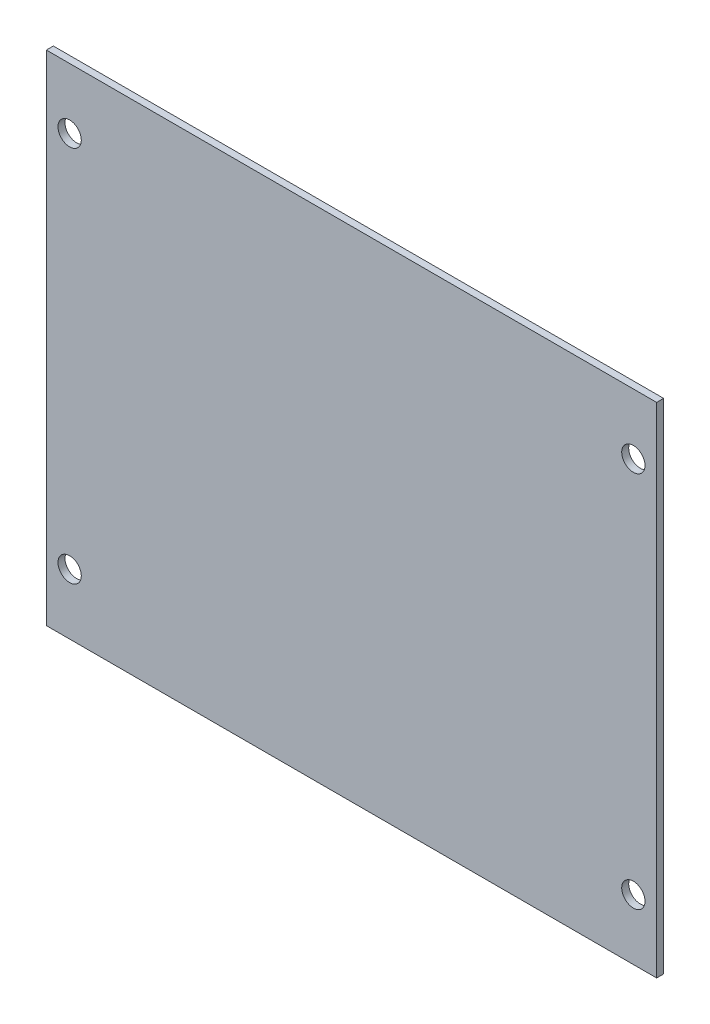
ISO-10303-21;
HEADER;
FILE_DESCRIPTION(('STEP AP214'),'2;1');
FILE_NAME('part.step','',(''),(''),'','','');
FILE_SCHEMA(('AUTOMOTIVE_DESIGN { 1 0 10303 214 1 1 1 1 }'));
ENDSEC;
DATA;
#1=APPLICATION_CONTEXT('core data for automotive mechanical design processes');
#2=APPLICATION_PROTOCOL_DEFINITION('international standard','automotive_design',2000,#1);
#3=PRODUCT_CONTEXT('',#1,'mechanical');
#4=PRODUCT('Part','Part','',(#3));
#5=PRODUCT_RELATED_PRODUCT_CATEGORY('part','',(#4));
#6=PRODUCT_DEFINITION_FORMATION('','',#4);
#7=PRODUCT_DEFINITION_CONTEXT('part definition',#1,'design');
#8=PRODUCT_DEFINITION('design','',#6,#7);
#9=PRODUCT_DEFINITION_SHAPE('','',#8);
#10=(LENGTH_UNIT() NAMED_UNIT(*) SI_UNIT(.MILLI.,.METRE.));
#11=(NAMED_UNIT(*) PLANE_ANGLE_UNIT() SI_UNIT($,.RADIAN.));
#12=(NAMED_UNIT(*) SI_UNIT($,.STERADIAN.) SOLID_ANGLE_UNIT());
#13=UNCERTAINTY_MEASURE_WITH_UNIT(LENGTH_MEASURE(1.E-05),#10,'distance_accuracy_value','');
#14=(GEOMETRIC_REPRESENTATION_CONTEXT(3) GLOBAL_UNCERTAINTY_ASSIGNED_CONTEXT((#13)) GLOBAL_UNIT_ASSIGNED_CONTEXT((#10,
#11,#12)) REPRESENTATION_CONTEXT('',''));
#15=CARTESIAN_POINT('',(0.,0.,0.));
#16=DIRECTION('',(0.,0.,1.));
#17=DIRECTION('',(1.,0.,0.));
#18=AXIS2_PLACEMENT_3D('',#15,#16,#17);
#19=CARTESIAN_POINT('',(-55.0355249406901,36.5593129963155,1.5));
#20=DIRECTION('',(1.,0.,0.));
#21=DIRECTION('',(0.,1.,0.));
#22=AXIS2_PLACEMENT_3D('',#19,#20,#21);
#23=PLANE('',#22);
#24=DIRECTION('',(0.,-1.,0.));
#25=VECTOR('',#24,1.);
#26=CARTESIAN_POINT('',(-55.0355249406901,36.5593129963155,0.));
#27=LINE('',#26,#25);
#28=CARTESIAN_POINT('',(-55.0355249406901,36.5593129963155,0.));
#29=VERTEX_POINT('',#28);
#30=CARTESIAN_POINT('',(-55.03552494069,-70.4406870036845,0.));
#31=VERTEX_POINT('',#30);
#32=EDGE_CURVE('E98',#29,#31,#27,.T.);
#33=ORIENTED_EDGE('',*,*,#32,.T.);
#34=DIRECTION('',(0.,0.,-1.));
#35=VECTOR('',#34,1.);
#36=CARTESIAN_POINT('',(-55.03552494069,-70.4406870036845,1.5));
#37=LINE('',#36,#35);
#38=CARTESIAN_POINT('',(-55.03552494069,-70.4406870036845,1.5));
#39=VERTEX_POINT('',#38);
#40=EDGE_CURVE('E11',#39,#31,#37,.T.);
#41=ORIENTED_EDGE('',*,*,#40,.F.);
#42=DIRECTION('',(0.,-1.,0.));
#43=VECTOR('',#42,1.);
#44=CARTESIAN_POINT('',(-55.0355249406901,36.5593129963155,1.5));
#45=LINE('',#44,#43);
#46=CARTESIAN_POINT('',(-55.0355249406901,36.5593129963155,1.5));
#47=VERTEX_POINT('',#46);
#48=EDGE_CURVE('E86',#47,#39,#45,.T.);
#49=ORIENTED_EDGE('',*,*,#48,.F.);
#50=DIRECTION('',(0.,0.,-1.));
#51=VECTOR('',#50,1.);
#52=CARTESIAN_POINT('',(-55.0355249406901,36.5593129963155,1.5));
#53=LINE('',#52,#51);
#54=EDGE_CURVE('E94',#47,#29,#53,.T.);
#55=ORIENTED_EDGE('',*,*,#54,.T.);
#56=EDGE_LOOP('',(#33,#41,#49,#55));
#57=FACE_BOUND('',#56,.T.);
#58=ADVANCED_FACE('F35',(#57),#23,.F.);
#59=CARTESIAN_POINT('',(-55.03552494069,-70.4406870036845,1.5));
#60=DIRECTION('',(0.,1.,0.));
#61=DIRECTION('',(0.,0.,1.));
#62=AXIS2_PLACEMENT_3D('',#59,#60,#61);
#63=PLANE('',#62);
#64=DIRECTION('',(1.,0.,0.));
#65=VECTOR('',#64,1.);
#66=CARTESIAN_POINT('',(-55.03552494069,-70.4406870036845,0.));
#67=LINE('',#66,#65);
#68=CARTESIAN_POINT('',(75.96447505931,-70.4406870036845,0.));
#69=VERTEX_POINT('',#68);
#70=EDGE_CURVE('E90',#31,#69,#67,.T.);
#71=ORIENTED_EDGE('',*,*,#70,.T.);
#72=DIRECTION('',(0.,0.,-1.));
#73=VECTOR('',#72,1.);
#74=CARTESIAN_POINT('',(75.96447505931,-70.4406870036845,1.5));
#75=LINE('',#74,#73);
#76=CARTESIAN_POINT('',(75.96447505931,-70.4406870036845,1.5));
#77=VERTEX_POINT('',#76);
#78=EDGE_CURVE('E43',#77,#69,#75,.T.);
#79=ORIENTED_EDGE('',*,*,#78,.F.);
#80=DIRECTION('',(1.,0.,0.));
#81=VECTOR('',#80,1.);
#82=CARTESIAN_POINT('',(-55.03552494069,-70.4406870036845,1.5));
#83=LINE('',#82,#81);
#84=EDGE_CURVE('E81',#39,#77,#83,.T.);
#85=ORIENTED_EDGE('',*,*,#84,.F.);
#86=ORIENTED_EDGE('',*,*,#40,.T.);
#87=EDGE_LOOP('',(#71,#79,#85,#86));
#88=FACE_BOUND('',#87,.T.);
#89=ADVANCED_FACE('F89',(#88),#63,.F.);
#90=CARTESIAN_POINT('',(75.9644750593099,36.5593129963155,1.5));
#91=DIRECTION('',(-1.,0.,0.));
#92=DIRECTION('',(0.,-1.,0.));
#93=AXIS2_PLACEMENT_3D('',#90,#91,#92);
#94=PLANE('',#93);
#95=DIRECTION('',(0.,1.,0.));
#96=VECTOR('',#95,1.);
#97=CARTESIAN_POINT('',(75.9644750593099,36.5593129963155,0.));
#98=LINE('',#97,#96);
#99=CARTESIAN_POINT('',(75.9644750593099,36.5593129963155,0.));
#100=VERTEX_POINT('',#99);
#101=EDGE_CURVE('E68',#69,#100,#98,.T.);
#102=ORIENTED_EDGE('',*,*,#101,.T.);
#103=DIRECTION('',(0.,0.,-1.));
#104=VECTOR('',#103,1.);
#105=CARTESIAN_POINT('',(75.9644750593099,36.5593129963155,1.5));
#106=LINE('',#105,#104);
#107=CARTESIAN_POINT('',(75.9644750593099,36.5593129963155,1.5));
#108=VERTEX_POINT('',#107);
#109=EDGE_CURVE('E91',#108,#100,#106,.T.);
#110=ORIENTED_EDGE('',*,*,#109,.F.);
#111=DIRECTION('',(0.,1.,0.));
#112=VECTOR('',#111,1.);
#113=CARTESIAN_POINT('',(75.9644750593099,36.5593129963155,1.5));
#114=LINE('',#113,#112);
#115=EDGE_CURVE('E84',#77,#108,#114,.T.);
#116=ORIENTED_EDGE('',*,*,#115,.F.);
#117=ORIENTED_EDGE('',*,*,#78,.T.);
#118=EDGE_LOOP('',(#102,#110,#116,#117));
#119=FACE_BOUND('',#118,.T.);
#120=ADVANCED_FACE('F92',(#119),#94,.F.);
#121=CARTESIAN_POINT('',(-55.0355249406901,36.5593129963155,1.5));
#122=DIRECTION('',(0.,-1.,0.));
#123=DIRECTION('',(0.,0.,-1.));
#124=AXIS2_PLACEMENT_3D('',#121,#122,#123);
#125=PLANE('',#124);
#126=DIRECTION('',(-1.,0.,0.));
#127=VECTOR('',#126,1.);
#128=CARTESIAN_POINT('',(-55.0355249406901,36.5593129963155,0.));
#129=LINE('',#128,#127);
#130=EDGE_CURVE('E74',#100,#29,#129,.T.);
#131=ORIENTED_EDGE('',*,*,#130,.T.);
#132=ORIENTED_EDGE('',*,*,#54,.F.);
#133=DIRECTION('',(-1.,0.,0.));
#134=VECTOR('',#133,1.);
#135=CARTESIAN_POINT('',(-55.0355249406901,36.5593129963155,1.5));
#136=LINE('',#135,#134);
#137=EDGE_CURVE('E51',#108,#47,#136,.T.);
#138=ORIENTED_EDGE('',*,*,#137,.F.);
#139=ORIENTED_EDGE('',*,*,#109,.T.);
#140=EDGE_LOOP('',(#131,#132,#138,#139));
#141=FACE_BOUND('',#140,.T.);
#142=ADVANCED_FACE('F106',(#141),#125,.F.);
#143=CARTESIAN_POINT('',(0.,0.,1.5));
#144=DIRECTION('',(0.,0.,1.));
#145=DIRECTION('',(1.,0.,0.));
#146=AXIS2_PLACEMENT_3D('',#143,#144,#145);
#147=PLANE('',#146);
#148=CARTESIAN_POINT('',(-50.0355249406901,-57.4406870036845,1.5));
#149=DIRECTION('',(0.,0.,1.));
#150=DIRECTION('',(1.,0.,0.));
#151=AXIS2_PLACEMENT_3D('',#148,#149,#150);
#152=CIRCLE('',#151,2.5);
#153=CARTESIAN_POINT('',(-47.5355249406901,-57.4406870036845,1.5));
#154=VERTEX_POINT('',#153);
#155=EDGE_CURVE('E132',#154,#154,#152,.T.);
#156=ORIENTED_EDGE('',*,*,#155,.F.);
#157=EDGE_LOOP('',(#156));
#158=FACE_BOUND('',#157,.T.);
#159=CARTESIAN_POINT('',(70.96447505931,-57.4406870036845,1.5));
#160=DIRECTION('',(0.,0.,1.));
#161=DIRECTION('',(1.,0.,0.));
#162=AXIS2_PLACEMENT_3D('',#159,#160,#161);
#163=CIRCLE('',#162,2.5);
#164=CARTESIAN_POINT('',(73.46447505931,-57.4406870036845,1.5));
#165=VERTEX_POINT('',#164);
#166=EDGE_CURVE('E126',#165,#165,#163,.T.);
#167=ORIENTED_EDGE('',*,*,#166,.F.);
#168=EDGE_LOOP('',(#167));
#169=FACE_BOUND('',#168,.T.);
#170=CARTESIAN_POINT('',(70.96447505931,23.5593129963155,1.5));
#171=DIRECTION('',(0.,0.,1.));
#172=DIRECTION('',(1.,0.,0.));
#173=AXIS2_PLACEMENT_3D('',#170,#171,#172);
#174=CIRCLE('',#173,2.50000000000001);
#175=CARTESIAN_POINT('',(73.46447505931,23.5593129963155,1.5));
#176=VERTEX_POINT('',#175);
#177=EDGE_CURVE('E120',#176,#176,#174,.T.);
#178=ORIENTED_EDGE('',*,*,#177,.F.);
#179=EDGE_LOOP('',(#178));
#180=FACE_BOUND('',#179,.T.);
#181=CARTESIAN_POINT('',(-50.0355249406901,23.5593129963155,1.5));
#182=DIRECTION('',(0.,0.,1.));
#183=DIRECTION('',(1.,0.,0.));
#184=AXIS2_PLACEMENT_3D('',#181,#182,#183);
#185=CIRCLE('',#184,2.5);
#186=CARTESIAN_POINT('',(-47.5355249406901,23.5593129963155,1.5));
#187=VERTEX_POINT('',#186);
#188=EDGE_CURVE('E114',#187,#187,#185,.T.);
#189=ORIENTED_EDGE('',*,*,#188,.F.);
#190=EDGE_LOOP('',(#189));
#191=FACE_BOUND('',#190,.T.);
#192=ORIENTED_EDGE('',*,*,#48,.T.);
#193=ORIENTED_EDGE('',*,*,#84,.T.);
#194=ORIENTED_EDGE('',*,*,#115,.T.);
#195=ORIENTED_EDGE('',*,*,#137,.T.);
#196=EDGE_LOOP('',(#192,#193,#194,#195));
#197=FACE_BOUND('',#196,.T.);
#198=ADVANCED_FACE('F82',(#158,#169,#180,#191,#197),#147,.T.);
#199=CARTESIAN_POINT('',(0.,0.,0.));
#200=DIRECTION('',(0.,0.,1.));
#201=DIRECTION('',(1.,0.,0.));
#202=AXIS2_PLACEMENT_3D('',#199,#200,#201);
#203=PLANE('',#202);
#204=CARTESIAN_POINT('',(-50.0355249406901,-57.4406870036845,0.));
#205=DIRECTION('',(0.,0.,1.));
#206=DIRECTION('',(1.,0.,0.));
#207=AXIS2_PLACEMENT_3D('',#204,#205,#206);
#208=CIRCLE('',#207,2.5);
#209=CARTESIAN_POINT('',(-47.5355249406901,-57.4406870036845,0.));
#210=VERTEX_POINT('',#209);
#211=EDGE_CURVE('E129',#210,#210,#208,.F.);
#212=ORIENTED_EDGE('',*,*,#211,.F.);
#213=EDGE_LOOP('',(#212));
#214=FACE_BOUND('',#213,.T.);
#215=CARTESIAN_POINT('',(70.96447505931,-57.4406870036845,0.));
#216=DIRECTION('',(0.,0.,1.));
#217=DIRECTION('',(1.,0.,0.));
#218=AXIS2_PLACEMENT_3D('',#215,#216,#217);
#219=CIRCLE('',#218,2.5);
#220=CARTESIAN_POINT('',(73.46447505931,-57.4406870036845,0.));
#221=VERTEX_POINT('',#220);
#222=EDGE_CURVE('E123',#221,#221,#219,.F.);
#223=ORIENTED_EDGE('',*,*,#222,.F.);
#224=EDGE_LOOP('',(#223));
#225=FACE_BOUND('',#224,.T.);
#226=CARTESIAN_POINT('',(70.96447505931,23.5593129963155,0.));
#227=DIRECTION('',(0.,0.,1.));
#228=DIRECTION('',(1.,0.,0.));
#229=AXIS2_PLACEMENT_3D('',#226,#227,#228);
#230=CIRCLE('',#229,2.50000000000001);
#231=CARTESIAN_POINT('',(73.46447505931,23.5593129963155,0.));
#232=VERTEX_POINT('',#231);
#233=EDGE_CURVE('E117',#232,#232,#230,.F.);
#234=ORIENTED_EDGE('',*,*,#233,.F.);
#235=EDGE_LOOP('',(#234));
#236=FACE_BOUND('',#235,.T.);
#237=CARTESIAN_POINT('',(-50.0355249406901,23.5593129963155,0.));
#238=DIRECTION('',(0.,0.,1.));
#239=DIRECTION('',(1.,0.,0.));
#240=AXIS2_PLACEMENT_3D('',#237,#238,#239);
#241=CIRCLE('',#240,2.5);
#242=CARTESIAN_POINT('',(-47.5355249406901,23.5593129963155,0.));
#243=VERTEX_POINT('',#242);
#244=EDGE_CURVE('E101',#243,#243,#241,.F.);
#245=ORIENTED_EDGE('',*,*,#244,.F.);
#246=EDGE_LOOP('',(#245));
#247=FACE_BOUND('',#246,.T.);
#248=ORIENTED_EDGE('',*,*,#32,.F.);
#249=ORIENTED_EDGE('',*,*,#130,.F.);
#250=ORIENTED_EDGE('',*,*,#101,.F.);
#251=ORIENTED_EDGE('',*,*,#70,.F.);
#252=EDGE_LOOP('',(#248,#249,#250,#251));
#253=FACE_BOUND('',#252,.T.);
#254=ADVANCED_FACE('F109',(#214,#225,#236,#247,#253),#203,.F.);
#255=CARTESIAN_POINT('',(-50.0355249406901,23.5593129963155,-0.000999999999999916));
#256=DIRECTION('',(0.,0.,1.));
#257=DIRECTION('',(1.,0.,0.));
#258=AXIS2_PLACEMENT_3D('',#255,#256,#257);
#259=CYLINDRICAL_SURFACE('',#258,2.5);
#260=ORIENTED_EDGE('',*,*,#188,.T.);
#261=EDGE_LOOP('',(#260));
#262=FACE_BOUND('',#261,.T.);
#263=ORIENTED_EDGE('',*,*,#244,.T.);
#264=EDGE_LOOP('',(#263));
#265=FACE_BOUND('',#264,.T.);
#266=ADVANCED_FACE('F148',(#262,#265),#259,.F.);
#267=CARTESIAN_POINT('',(70.96447505931,23.5593129963155,-0.000999999999999916));
#268=DIRECTION('',(0.,0.,1.));
#269=DIRECTION('',(1.,0.,0.));
#270=AXIS2_PLACEMENT_3D('',#267,#268,#269);
#271=CYLINDRICAL_SURFACE('',#270,2.50000000000001);
#272=ORIENTED_EDGE('',*,*,#177,.T.);
#273=EDGE_LOOP('',(#272));
#274=FACE_BOUND('',#273,.T.);
#275=ORIENTED_EDGE('',*,*,#233,.T.);
#276=EDGE_LOOP('',(#275));
#277=FACE_BOUND('',#276,.T.);
#278=ADVANCED_FACE('F151',(#274,#277),#271,.F.);
#279=CARTESIAN_POINT('',(70.96447505931,-57.4406870036845,-0.000999999999999916));
#280=DIRECTION('',(0.,0.,1.));
#281=DIRECTION('',(1.,0.,0.));
#282=AXIS2_PLACEMENT_3D('',#279,#280,#281);
#283=CYLINDRICAL_SURFACE('',#282,2.5);
#284=ORIENTED_EDGE('',*,*,#166,.T.);
#285=EDGE_LOOP('',(#284));
#286=FACE_BOUND('',#285,.T.);
#287=ORIENTED_EDGE('',*,*,#222,.T.);
#288=EDGE_LOOP('',(#287));
#289=FACE_BOUND('',#288,.T.);
#290=ADVANCED_FACE('F199',(#286,#289),#283,.F.);
#291=CARTESIAN_POINT('',(-50.0355249406901,-57.4406870036845,-0.000999999999999916));
#292=DIRECTION('',(0.,0.,1.));
#293=DIRECTION('',(1.,0.,0.));
#294=AXIS2_PLACEMENT_3D('',#291,#292,#293);
#295=CYLINDRICAL_SURFACE('',#294,2.5);
#296=ORIENTED_EDGE('',*,*,#155,.T.);
#297=EDGE_LOOP('',(#296));
#298=FACE_BOUND('',#297,.T.);
#299=ORIENTED_EDGE('',*,*,#211,.T.);
#300=EDGE_LOOP('',(#299));
#301=FACE_BOUND('',#300,.T.);
#302=ADVANCED_FACE('F136',(#298,#301),#295,.F.);
#303=CLOSED_SHELL('',(#58,#89,#120,#142,#198,#254,#266,#278,#290,#302));
#304=MANIFOLD_SOLID_BREP('B2',#303);
#305=ADVANCED_BREP_SHAPE_REPRESENTATION('',(#18,#304),#14);
#306=SHAPE_DEFINITION_REPRESENTATION(#9,#305);
ENDSEC;
END-ISO-10303-21;
